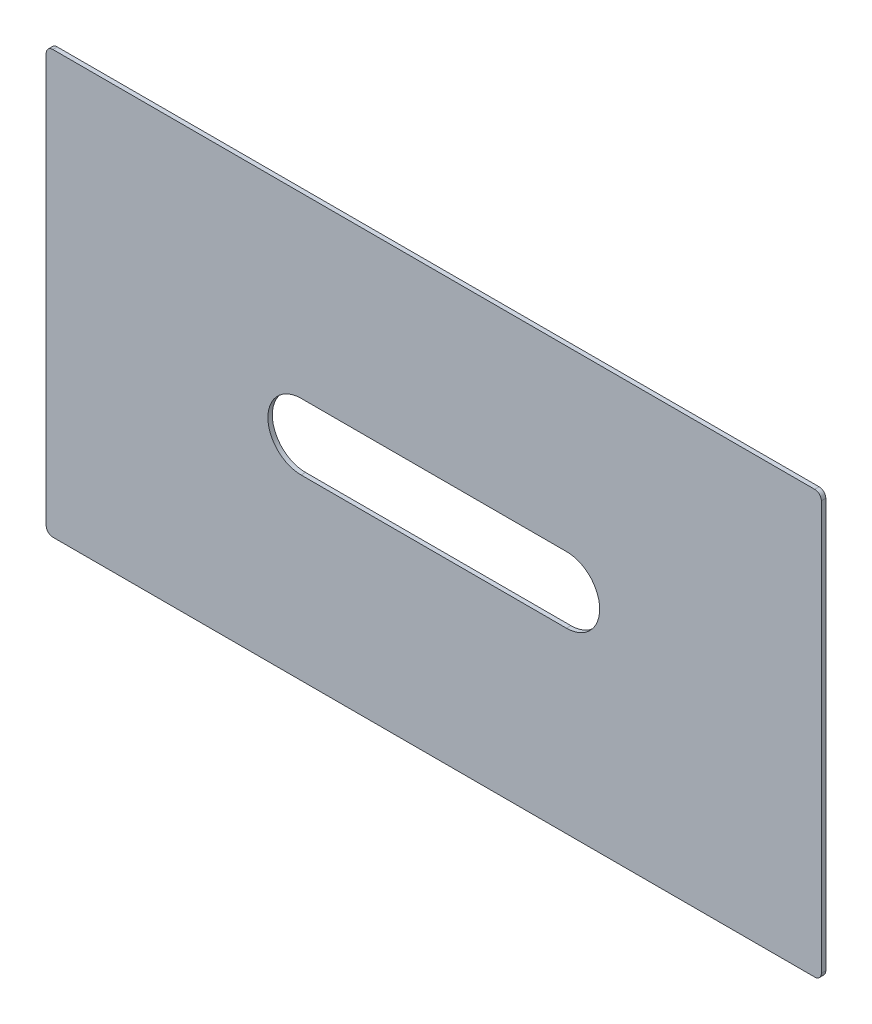
ISO-10303-21;
HEADER;
FILE_DESCRIPTION(('STEP AP214'),'2;1');
FILE_NAME('part.step','',(''),(''),'','','');
FILE_SCHEMA(('AUTOMOTIVE_DESIGN { 1 0 10303 214 1 1 1 1 }'));
ENDSEC;
DATA;
#1=APPLICATION_CONTEXT('core data for automotive mechanical design processes');
#2=APPLICATION_PROTOCOL_DEFINITION('international standard','automotive_design',2000,#1);
#3=PRODUCT_CONTEXT('',#1,'mechanical');
#4=PRODUCT('Part','Part','',(#3));
#5=PRODUCT_RELATED_PRODUCT_CATEGORY('part','',(#4));
#6=PRODUCT_DEFINITION_FORMATION('','',#4);
#7=PRODUCT_DEFINITION_CONTEXT('part definition',#1,'design');
#8=PRODUCT_DEFINITION('design','',#6,#7);
#9=PRODUCT_DEFINITION_SHAPE('','',#8);
#10=(LENGTH_UNIT() NAMED_UNIT(*) SI_UNIT(.MILLI.,.METRE.));
#11=(NAMED_UNIT(*) PLANE_ANGLE_UNIT() SI_UNIT($,.RADIAN.));
#12=(NAMED_UNIT(*) SI_UNIT($,.STERADIAN.) SOLID_ANGLE_UNIT());
#13=UNCERTAINTY_MEASURE_WITH_UNIT(LENGTH_MEASURE(1.E-05),#10,'distance_accuracy_value','');
#14=(GEOMETRIC_REPRESENTATION_CONTEXT(3) GLOBAL_UNCERTAINTY_ASSIGNED_CONTEXT((#13)) GLOBAL_UNIT_ASSIGNED_CONTEXT((#10,
#11,#12)) REPRESENTATION_CONTEXT('',''));
#15=CARTESIAN_POINT('',(0.,0.,0.));
#16=DIRECTION('',(0.,0.,1.));
#17=DIRECTION('',(1.,0.,0.));
#18=AXIS2_PLACEMENT_3D('',#15,#16,#17);
#19=CARTESIAN_POINT('',(-5.,-15.5,-2.));
#20=DIRECTION('',(-1.,0.,0.));
#21=DIRECTION('',(0.,-1.,0.));
#22=AXIS2_PLACEMENT_3D('',#19,#20,#21);
#23=PLANE('',#22);
#24=DIRECTION('',(0.,-1.,0.));
#25=VECTOR('',#24,1.);
#26=CARTESIAN_POINT('',(-5.,-15.5,-2.));
#27=LINE('',#26,#25);
#28=CARTESIAN_POINT('',(-5.,-18.5,-2.));
#29=VERTEX_POINT('',#28);
#30=CARTESIAN_POINT('',(-4.99999999999998,-203.5,-2.));
#31=VERTEX_POINT('',#30);
#32=EDGE_CURVE('E161',#29,#31,#27,.T.);
#33=ORIENTED_EDGE('',*,*,#32,.T.);
#34=DIRECTION('',(0.,0.,1.));
#35=VECTOR('',#34,1.);
#36=CARTESIAN_POINT('',(-4.99999999999998,-203.5,-2.));
#37=LINE('',#36,#35);
#38=CARTESIAN_POINT('',(-4.99999999999998,-203.5,0.));
#39=VERTEX_POINT('',#38);
#40=EDGE_CURVE('E186',#31,#39,#37,.T.);
#41=ORIENTED_EDGE('',*,*,#40,.T.);
#42=DIRECTION('',(0.,-1.,0.));
#43=VECTOR('',#42,1.);
#44=CARTESIAN_POINT('',(-5.,-15.5,0.));
#45=LINE('',#44,#43);
#46=CARTESIAN_POINT('',(-5.,-18.5,0.));
#47=VERTEX_POINT('',#46);
#48=EDGE_CURVE('E157',#47,#39,#45,.T.);
#49=ORIENTED_EDGE('',*,*,#48,.F.);
#50=DIRECTION('',(0.,0.,1.));
#51=VECTOR('',#50,1.);
#52=CARTESIAN_POINT('',(-5.,-18.5,-2.));
#53=LINE('',#52,#51);
#54=EDGE_CURVE('E174',#47,#29,#53,.F.);
#55=ORIENTED_EDGE('',*,*,#54,.T.);
#56=EDGE_LOOP('',(#33,#41,#49,#55));
#57=FACE_BOUND('',#56,.T.);
#58=ADVANCED_FACE('F35',(#57),#23,.T.);
#59=CARTESIAN_POINT('',(-5.,-15.5,-2.));
#60=DIRECTION('',(0.,1.,0.));
#61=DIRECTION('',(0.,0.,1.));
#62=AXIS2_PLACEMENT_3D('',#59,#60,#61);
#63=PLANE('',#62);
#64=DIRECTION('',(-1.,0.,0.));
#65=VECTOR('',#64,1.);
#66=CARTESIAN_POINT('',(-5.,-15.5,-2.));
#67=LINE('',#66,#65);
#68=CARTESIAN_POINT('',(342.5,-15.5,-2.));
#69=VERTEX_POINT('',#68);
#70=CARTESIAN_POINT('',(-2.,-15.5,-2.));
#71=VERTEX_POINT('',#70);
#72=EDGE_CURVE('E171',#69,#71,#67,.T.);
#73=ORIENTED_EDGE('',*,*,#72,.T.);
#74=DIRECTION('',(0.,0.,1.));
#75=VECTOR('',#74,1.);
#76=CARTESIAN_POINT('',(-2.,-15.5,-2.));
#77=LINE('',#76,#75);
#78=CARTESIAN_POINT('',(-2.,-15.5,0.));
#79=VERTEX_POINT('',#78);
#80=EDGE_CURVE('E11',#71,#79,#77,.T.);
#81=ORIENTED_EDGE('',*,*,#80,.T.);
#82=DIRECTION('',(-1.,0.,0.));
#83=VECTOR('',#82,1.);
#84=CARTESIAN_POINT('',(-5.,-15.5,0.));
#85=LINE('',#84,#83);
#86=CARTESIAN_POINT('',(342.5,-15.5,0.));
#87=VERTEX_POINT('',#86);
#88=EDGE_CURVE('E165',#87,#79,#85,.T.);
#89=ORIENTED_EDGE('',*,*,#88,.F.);
#90=DIRECTION('',(0.,0.,1.));
#91=VECTOR('',#90,1.);
#92=CARTESIAN_POINT('',(342.5,-15.5,-2.));
#93=LINE('',#92,#91);
#94=EDGE_CURVE('E43',#87,#69,#93,.F.);
#95=ORIENTED_EDGE('',*,*,#94,.T.);
#96=EDGE_LOOP('',(#73,#81,#89,#95));
#97=FACE_BOUND('',#96,.T.);
#98=ADVANCED_FACE('F218',(#97),#63,.T.);
#99=CARTESIAN_POINT('',(345.5,-15.5,-2.));
#100=DIRECTION('',(1.,0.,0.));
#101=DIRECTION('',(0.,0.,-1.));
#102=AXIS2_PLACEMENT_3D('',#99,#100,#101);
#103=PLANE('',#102);
#104=DIRECTION('',(0.,1.,0.));
#105=VECTOR('',#104,1.);
#106=CARTESIAN_POINT('',(345.5,-15.5,0.));
#107=LINE('',#106,#105);
#108=CARTESIAN_POINT('',(345.5,-203.5,0.));
#109=VERTEX_POINT('',#108);
#110=CARTESIAN_POINT('',(345.5,-18.5,0.));
#111=VERTEX_POINT('',#110);
#112=EDGE_CURVE('E180',#109,#111,#107,.T.);
#113=ORIENTED_EDGE('',*,*,#112,.F.);
#114=DIRECTION('',(0.,0.,1.));
#115=VECTOR('',#114,1.);
#116=CARTESIAN_POINT('',(345.5,-203.5,-2.));
#117=LINE('',#116,#115);
#118=CARTESIAN_POINT('',(345.5,-203.5,-2.));
#119=VERTEX_POINT('',#118);
#120=EDGE_CURVE('E213',#109,#119,#117,.F.);
#121=ORIENTED_EDGE('',*,*,#120,.T.);
#122=DIRECTION('',(0.,1.,0.));
#123=VECTOR('',#122,1.);
#124=CARTESIAN_POINT('',(345.5,-15.5,-2.));
#125=LINE('',#124,#123);
#126=CARTESIAN_POINT('',(345.5,-18.5,-2.));
#127=VERTEX_POINT('',#126);
#128=EDGE_CURVE('E168',#119,#127,#125,.T.);
#129=ORIENTED_EDGE('',*,*,#128,.T.);
#130=DIRECTION('',(0.,0.,1.));
#131=VECTOR('',#130,1.);
#132=CARTESIAN_POINT('',(345.5,-18.5,-2.));
#133=LINE('',#132,#131);
#134=EDGE_CURVE('E210',#127,#111,#133,.T.);
#135=ORIENTED_EDGE('',*,*,#134,.T.);
#136=EDGE_LOOP('',(#113,#121,#129,#135));
#137=FACE_BOUND('',#136,.T.);
#138=ADVANCED_FACE('F229',(#137),#103,.T.);
#139=CARTESIAN_POINT('',(-4.99999999999998,-206.5,-2.));
#140=DIRECTION('',(0.,-1.,0.));
#141=DIRECTION('',(0.,0.,-1.));
#142=AXIS2_PLACEMENT_3D('',#139,#140,#141);
#143=PLANE('',#142);
#144=DIRECTION('',(1.,0.,0.));
#145=VECTOR('',#144,1.);
#146=CARTESIAN_POINT('',(-4.99999999999998,-206.5,0.));
#147=LINE('',#146,#145);
#148=CARTESIAN_POINT('',(-1.99999999999998,-206.5,0.));
#149=VERTEX_POINT('',#148);
#150=CARTESIAN_POINT('',(342.5,-206.5,0.));
#151=VERTEX_POINT('',#150);
#152=EDGE_CURVE('E177',#149,#151,#147,.T.);
#153=ORIENTED_EDGE('',*,*,#152,.F.);
#154=DIRECTION('',(0.,0.,1.));
#155=VECTOR('',#154,1.);
#156=CARTESIAN_POINT('',(-1.99999999999998,-206.5,-2.));
#157=LINE('',#156,#155);
#158=CARTESIAN_POINT('',(-1.99999999999998,-206.5,-2.));
#159=VERTEX_POINT('',#158);
#160=EDGE_CURVE('E200',#149,#159,#157,.F.);
#161=ORIENTED_EDGE('',*,*,#160,.T.);
#162=DIRECTION('',(1.,0.,0.));
#163=VECTOR('',#162,1.);
#164=CARTESIAN_POINT('',(-4.99999999999998,-206.5,-2.));
#165=LINE('',#164,#163);
#166=CARTESIAN_POINT('',(342.5,-206.5,-2.));
#167=VERTEX_POINT('',#166);
#168=EDGE_CURVE('E164',#159,#167,#165,.T.);
#169=ORIENTED_EDGE('',*,*,#168,.T.);
#170=DIRECTION('',(0.,0.,1.));
#171=VECTOR('',#170,1.);
#172=CARTESIAN_POINT('',(342.5,-206.5,-2.));
#173=LINE('',#172,#171);
#174=EDGE_CURVE('E197',#167,#151,#173,.T.);
#175=ORIENTED_EDGE('',*,*,#174,.T.);
#176=EDGE_LOOP('',(#153,#161,#169,#175));
#177=FACE_BOUND('',#176,.T.);
#178=ADVANCED_FACE('F239',(#177),#143,.T.);
#179=CARTESIAN_POINT('',(0.,0.,-2.));
#180=DIRECTION('',(0.,0.,1.));
#181=DIRECTION('',(1.,0.,0.));
#182=AXIS2_PLACEMENT_3D('',#179,#180,#181);
#183=PLANE('',#182);
#184=DIRECTION('',(-1.,0.,0.));
#185=VECTOR('',#184,1.);
#186=CARTESIAN_POINT('',(110.25,-96.,-2.));
#187=LINE('',#186,#185);
#188=CARTESIAN_POINT('',(230.25,-96.,-2.));
#189=VERTEX_POINT('',#188);
#190=CARTESIAN_POINT('',(110.25,-96.,-2.));
#191=VERTEX_POINT('',#190);
#192=EDGE_CURVE('E132',#189,#191,#187,.T.);
#193=ORIENTED_EDGE('',*,*,#192,.T.);
#194=CARTESIAN_POINT('',(110.25,-111.,-2.));
#195=DIRECTION('',(0.,0.,1.));
#196=DIRECTION('',(1.,0.,0.));
#197=AXIS2_PLACEMENT_3D('',#194,#195,#196);
#198=CIRCLE('',#197,15.);
#199=CARTESIAN_POINT('',(110.25,-126.,-2.));
#200=VERTEX_POINT('',#199);
#201=EDGE_CURVE('E126',#191,#200,#198,.T.);
#202=ORIENTED_EDGE('',*,*,#201,.T.);
#203=DIRECTION('',(1.,0.,0.));
#204=VECTOR('',#203,1.);
#205=CARTESIAN_POINT('',(110.25,-126.,-2.));
#206=LINE('',#205,#204);
#207=CARTESIAN_POINT('',(230.25,-126.,-2.));
#208=VERTEX_POINT('',#207);
#209=EDGE_CURVE('E135',#200,#208,#206,.T.);
#210=ORIENTED_EDGE('',*,*,#209,.T.);
#211=CARTESIAN_POINT('',(230.25,-111.,-2.));
#212=DIRECTION('',(0.,0.,1.));
#213=DIRECTION('',(1.,0.,0.));
#214=AXIS2_PLACEMENT_3D('',#211,#212,#213);
#215=CIRCLE('',#214,15.);
#216=EDGE_CURVE('E50',#208,#189,#215,.T.);
#217=ORIENTED_EDGE('',*,*,#216,.T.);
#218=EDGE_LOOP('',(#193,#202,#210,#217));
#219=FACE_BOUND('',#218,.T.);
#220=ORIENTED_EDGE('',*,*,#168,.F.);
#221=CARTESIAN_POINT('',(-1.99999999999998,-203.5,-2.));
#222=DIRECTION('',(0.,0.,1.));
#223=DIRECTION('',(1.,0.,0.));
#224=AXIS2_PLACEMENT_3D('',#221,#222,#223);
#225=CIRCLE('',#224,3.);
#226=EDGE_CURVE('E208',#159,#31,#225,.F.);
#227=ORIENTED_EDGE('',*,*,#226,.T.);
#228=ORIENTED_EDGE('',*,*,#32,.F.);
#229=CARTESIAN_POINT('',(-2.,-18.5,-2.));
#230=DIRECTION('',(0.,0.,1.));
#231=DIRECTION('',(1.,0.,0.));
#232=AXIS2_PLACEMENT_3D('',#229,#230,#231);
#233=CIRCLE('',#232,3.);
#234=EDGE_CURVE('E204',#29,#71,#233,.F.);
#235=ORIENTED_EDGE('',*,*,#234,.T.);
#236=ORIENTED_EDGE('',*,*,#72,.F.);
#237=CARTESIAN_POINT('',(342.5,-18.5,-2.));
#238=DIRECTION('',(0.,0.,1.));
#239=DIRECTION('',(1.,0.,0.));
#240=AXIS2_PLACEMENT_3D('',#237,#238,#239);
#241=CIRCLE('',#240,3.);
#242=EDGE_CURVE('E202',#69,#127,#241,.F.);
#243=ORIENTED_EDGE('',*,*,#242,.T.);
#244=ORIENTED_EDGE('',*,*,#128,.F.);
#245=CARTESIAN_POINT('',(342.5,-203.5,-2.));
#246=DIRECTION('',(0.,0.,1.));
#247=DIRECTION('',(1.,0.,0.));
#248=AXIS2_PLACEMENT_3D('',#245,#246,#247);
#249=CIRCLE('',#248,3.);
#250=EDGE_CURVE('E206',#119,#167,#249,.F.);
#251=ORIENTED_EDGE('',*,*,#250,.T.);
#252=EDGE_LOOP('',(#220,#227,#228,#235,#236,#243,#244,#251));
#253=FACE_BOUND('',#252,.T.);
#254=ADVANCED_FACE('F139',(#219,#253),#183,.F.);
#255=CARTESIAN_POINT('',(0.,0.,0.));
#256=DIRECTION('',(0.,0.,1.));
#257=DIRECTION('',(1.,0.,0.));
#258=AXIS2_PLACEMENT_3D('',#255,#256,#257);
#259=PLANE('',#258);
#260=CARTESIAN_POINT('',(110.25,-111.,0.));
#261=DIRECTION('',(0.,0.,1.));
#262=DIRECTION('',(1.,0.,0.));
#263=AXIS2_PLACEMENT_3D('',#260,#261,#262);
#264=CIRCLE('',#263,15.);
#265=CARTESIAN_POINT('',(110.25,-96.,0.));
#266=VERTEX_POINT('',#265);
#267=CARTESIAN_POINT('',(110.25,-126.,0.));
#268=VERTEX_POINT('',#267);
#269=EDGE_CURVE('E58',#266,#268,#264,.T.);
#270=ORIENTED_EDGE('',*,*,#269,.F.);
#271=DIRECTION('',(-1.,0.,0.));
#272=VECTOR('',#271,1.);
#273=CARTESIAN_POINT('',(110.25,-96.,0.));
#274=LINE('',#273,#272);
#275=CARTESIAN_POINT('',(230.25,-96.,0.));
#276=VERTEX_POINT('',#275);
#277=EDGE_CURVE('E142',#276,#266,#274,.T.);
#278=ORIENTED_EDGE('',*,*,#277,.F.);
#279=CARTESIAN_POINT('',(230.25,-111.,0.));
#280=DIRECTION('',(0.,0.,1.));
#281=DIRECTION('',(1.,0.,0.));
#282=AXIS2_PLACEMENT_3D('',#279,#280,#281);
#283=CIRCLE('',#282,15.);
#284=CARTESIAN_POINT('',(230.25,-126.,0.));
#285=VERTEX_POINT('',#284);
#286=EDGE_CURVE('E145',#285,#276,#283,.T.);
#287=ORIENTED_EDGE('',*,*,#286,.F.);
#288=DIRECTION('',(1.,0.,0.));
#289=VECTOR('',#288,1.);
#290=CARTESIAN_POINT('',(110.25,-126.,0.));
#291=LINE('',#290,#289);
#292=EDGE_CURVE('E151',#268,#285,#291,.T.);
#293=ORIENTED_EDGE('',*,*,#292,.F.);
#294=EDGE_LOOP('',(#270,#278,#287,#293));
#295=FACE_BOUND('',#294,.T.);
#296=ORIENTED_EDGE('',*,*,#48,.T.);
#297=CARTESIAN_POINT('',(-1.99999999999998,-203.5,0.));
#298=DIRECTION('',(0.,0.,1.));
#299=DIRECTION('',(1.,0.,0.));
#300=AXIS2_PLACEMENT_3D('',#297,#298,#299);
#301=CIRCLE('',#300,3.);
#302=EDGE_CURVE('E195',#39,#149,#301,.T.);
#303=ORIENTED_EDGE('',*,*,#302,.T.);
#304=ORIENTED_EDGE('',*,*,#152,.T.);
#305=CARTESIAN_POINT('',(342.5,-203.5,0.));
#306=DIRECTION('',(0.,0.,1.));
#307=DIRECTION('',(1.,0.,0.));
#308=AXIS2_PLACEMENT_3D('',#305,#306,#307);
#309=CIRCLE('',#308,3.);
#310=EDGE_CURVE('E193',#151,#109,#309,.T.);
#311=ORIENTED_EDGE('',*,*,#310,.T.);
#312=ORIENTED_EDGE('',*,*,#112,.T.);
#313=CARTESIAN_POINT('',(342.5,-18.5,0.));
#314=DIRECTION('',(0.,0.,1.));
#315=DIRECTION('',(1.,0.,0.));
#316=AXIS2_PLACEMENT_3D('',#313,#314,#315);
#317=CIRCLE('',#316,3.);
#318=EDGE_CURVE('E189',#111,#87,#317,.T.);
#319=ORIENTED_EDGE('',*,*,#318,.T.);
#320=ORIENTED_EDGE('',*,*,#88,.T.);
#321=CARTESIAN_POINT('',(-2.,-18.5,0.));
#322=DIRECTION('',(0.,0.,1.));
#323=DIRECTION('',(1.,0.,0.));
#324=AXIS2_PLACEMENT_3D('',#321,#322,#323);
#325=CIRCLE('',#324,3.);
#326=EDGE_CURVE('E191',#79,#47,#325,.T.);
#327=ORIENTED_EDGE('',*,*,#326,.T.);
#328=EDGE_LOOP('',(#296,#303,#304,#311,#312,#319,#320,#327));
#329=FACE_BOUND('',#328,.T.);
#330=ADVANCED_FACE('F232',(#295,#329),#259,.T.);
#331=CARTESIAN_POINT('',(-1.99999999999998,-203.5,-2.));
#332=DIRECTION('',(0.,0.,1.));
#333=DIRECTION('',(1.,0.,0.));
#334=AXIS2_PLACEMENT_3D('',#331,#332,#333);
#335=CYLINDRICAL_SURFACE('',#334,3.);
#336=ORIENTED_EDGE('',*,*,#226,.F.);
#337=ORIENTED_EDGE('',*,*,#160,.F.);
#338=ORIENTED_EDGE('',*,*,#302,.F.);
#339=ORIENTED_EDGE('',*,*,#40,.F.);
#340=EDGE_LOOP('',(#336,#337,#338,#339));
#341=FACE_BOUND('',#340,.T.);
#342=ADVANCED_FACE('F244',(#341),#335,.T.);
#343=CARTESIAN_POINT('',(342.5,-203.5,-2.));
#344=DIRECTION('',(0.,0.,1.));
#345=DIRECTION('',(1.,0.,0.));
#346=AXIS2_PLACEMENT_3D('',#343,#344,#345);
#347=CYLINDRICAL_SURFACE('',#346,3.);
#348=ORIENTED_EDGE('',*,*,#250,.F.);
#349=ORIENTED_EDGE('',*,*,#120,.F.);
#350=ORIENTED_EDGE('',*,*,#310,.F.);
#351=ORIENTED_EDGE('',*,*,#174,.F.);
#352=EDGE_LOOP('',(#348,#349,#350,#351));
#353=FACE_BOUND('',#352,.T.);
#354=ADVANCED_FACE('F237',(#353),#347,.T.);
#355=CARTESIAN_POINT('',(-2.,-18.5,-2.));
#356=DIRECTION('',(0.,0.,1.));
#357=DIRECTION('',(1.,0.,0.));
#358=AXIS2_PLACEMENT_3D('',#355,#356,#357);
#359=CYLINDRICAL_SURFACE('',#358,3.);
#360=ORIENTED_EDGE('',*,*,#234,.F.);
#361=ORIENTED_EDGE('',*,*,#54,.F.);
#362=ORIENTED_EDGE('',*,*,#326,.F.);
#363=ORIENTED_EDGE('',*,*,#80,.F.);
#364=EDGE_LOOP('',(#360,#361,#362,#363));
#365=FACE_BOUND('',#364,.T.);
#366=ADVANCED_FACE('F249',(#365),#359,.T.);
#367=CARTESIAN_POINT('',(342.5,-18.5,-2.));
#368=DIRECTION('',(0.,0.,1.));
#369=DIRECTION('',(1.,0.,0.));
#370=AXIS2_PLACEMENT_3D('',#367,#368,#369);
#371=CYLINDRICAL_SURFACE('',#370,3.);
#372=ORIENTED_EDGE('',*,*,#242,.F.);
#373=ORIENTED_EDGE('',*,*,#94,.F.);
#374=ORIENTED_EDGE('',*,*,#318,.F.);
#375=ORIENTED_EDGE('',*,*,#134,.F.);
#376=EDGE_LOOP('',(#372,#373,#374,#375));
#377=FACE_BOUND('',#376,.T.);
#378=ADVANCED_FACE('F37',(#377),#371,.T.);
#379=CARTESIAN_POINT('',(110.25,-111.,-2.));
#380=DIRECTION('',(0.,0.,1.));
#381=DIRECTION('',(1.,0.,0.));
#382=AXIS2_PLACEMENT_3D('',#379,#380,#381);
#383=CYLINDRICAL_SURFACE('',#382,15.);
#384=ORIENTED_EDGE('',*,*,#269,.T.);
#385=DIRECTION('',(0.,0.,1.));
#386=VECTOR('',#385,1.);
#387=CARTESIAN_POINT('',(110.25,-126.,-2.));
#388=LINE('',#387,#386);
#389=EDGE_CURVE('E122',#200,#268,#388,.T.);
#390=ORIENTED_EDGE('',*,*,#389,.F.);
#391=ORIENTED_EDGE('',*,*,#201,.F.);
#392=DIRECTION('',(0.,0.,1.));
#393=VECTOR('',#392,1.);
#394=CARTESIAN_POINT('',(110.25,-96.,-2.));
#395=LINE('',#394,#393);
#396=EDGE_CURVE('E155',#191,#266,#395,.T.);
#397=ORIENTED_EDGE('',*,*,#396,.T.);
#398=EDGE_LOOP('',(#384,#390,#391,#397));
#399=FACE_BOUND('',#398,.T.);
#400=ADVANCED_FACE('F124',(#399),#383,.F.);
#401=CARTESIAN_POINT('',(110.25,-96.,-2.));
#402=DIRECTION('',(0.,1.,0.));
#403=DIRECTION('',(-1.,0.,0.));
#404=AXIS2_PLACEMENT_3D('',#401,#402,#403);
#405=PLANE('',#404);
#406=ORIENTED_EDGE('',*,*,#277,.T.);
#407=ORIENTED_EDGE('',*,*,#396,.F.);
#408=ORIENTED_EDGE('',*,*,#192,.F.);
#409=DIRECTION('',(0.,0.,1.));
#410=VECTOR('',#409,1.);
#411=CARTESIAN_POINT('',(230.25,-96.,-2.));
#412=LINE('',#411,#410);
#413=EDGE_CURVE('E158',#189,#276,#412,.T.);
#414=ORIENTED_EDGE('',*,*,#413,.T.);
#415=EDGE_LOOP('',(#406,#407,#408,#414));
#416=FACE_BOUND('',#415,.T.);
#417=ADVANCED_FACE('F324',(#416),#405,.F.);
#418=CARTESIAN_POINT('',(230.25,-111.,-2.));
#419=DIRECTION('',(0.,0.,1.));
#420=DIRECTION('',(1.,0.,0.));
#421=AXIS2_PLACEMENT_3D('',#418,#419,#420);
#422=CYLINDRICAL_SURFACE('',#421,15.);
#423=ORIENTED_EDGE('',*,*,#286,.T.);
#424=ORIENTED_EDGE('',*,*,#413,.F.);
#425=ORIENTED_EDGE('',*,*,#216,.F.);
#426=DIRECTION('',(0.,0.,1.));
#427=VECTOR('',#426,1.);
#428=CARTESIAN_POINT('',(230.25,-126.,-2.));
#429=LINE('',#428,#427);
#430=EDGE_CURVE('E131',#208,#285,#429,.T.);
#431=ORIENTED_EDGE('',*,*,#430,.T.);
#432=EDGE_LOOP('',(#423,#424,#425,#431));
#433=FACE_BOUND('',#432,.T.);
#434=ADVANCED_FACE('F332',(#433),#422,.F.);
#435=CARTESIAN_POINT('',(110.25,-126.,-2.));
#436=DIRECTION('',(0.,-1.,0.));
#437=DIRECTION('',(1.,0.,0.));
#438=AXIS2_PLACEMENT_3D('',#435,#436,#437);
#439=PLANE('',#438);
#440=ORIENTED_EDGE('',*,*,#292,.T.);
#441=ORIENTED_EDGE('',*,*,#430,.F.);
#442=ORIENTED_EDGE('',*,*,#209,.F.);
#443=ORIENTED_EDGE('',*,*,#389,.T.);
#444=EDGE_LOOP('',(#440,#441,#442,#443));
#445=FACE_BOUND('',#444,.T.);
#446=ADVANCED_FACE('F136',(#445),#439,.F.);
#447=CLOSED_SHELL('',(#58,#98,#138,#178,#254,#330,#342,#354,#366,#378,#400,#417,#434,#446));
#448=MANIFOLD_SOLID_BREP('B2',#447);
#449=ADVANCED_BREP_SHAPE_REPRESENTATION('',(#18,#448),#14);
#450=SHAPE_DEFINITION_REPRESENTATION(#9,#449);
ENDSEC;
END-ISO-10303-21;
